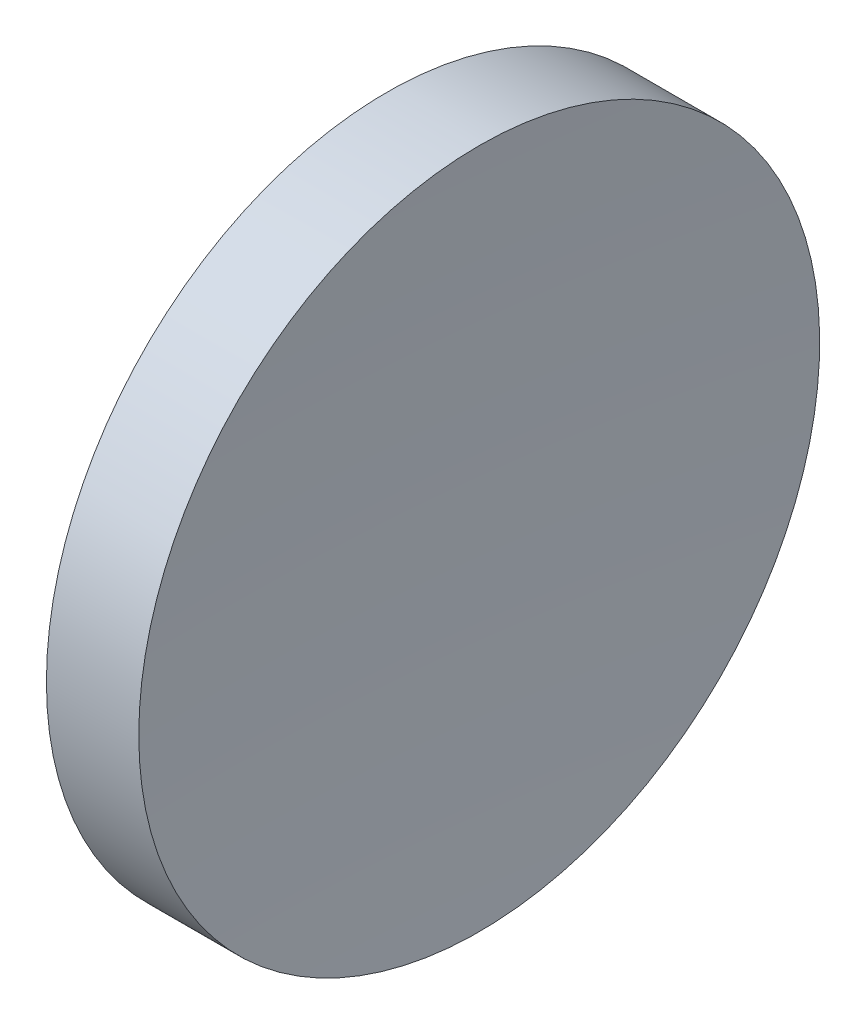
ISO-10303-21;
HEADER;
FILE_DESCRIPTION(('STEP AP214'),'2;1');
FILE_NAME('part.step','',(''),(''),'','','');
FILE_SCHEMA(('AUTOMOTIVE_DESIGN { 1 0 10303 214 1 1 1 1 }'));
ENDSEC;
DATA;
#1=APPLICATION_CONTEXT('core data for automotive mechanical design processes');
#2=APPLICATION_PROTOCOL_DEFINITION('international standard','automotive_design',2000,#1);
#3=PRODUCT_CONTEXT('',#1,'mechanical');
#4=PRODUCT('Part','Part','',(#3));
#5=PRODUCT_RELATED_PRODUCT_CATEGORY('part','',(#4));
#6=PRODUCT_DEFINITION_FORMATION('','',#4);
#7=PRODUCT_DEFINITION_CONTEXT('part definition',#1,'design');
#8=PRODUCT_DEFINITION('design','',#6,#7);
#9=PRODUCT_DEFINITION_SHAPE('','',#8);
#10=(LENGTH_UNIT() NAMED_UNIT(*) SI_UNIT(.MILLI.,.METRE.));
#11=(NAMED_UNIT(*) PLANE_ANGLE_UNIT() SI_UNIT($,.RADIAN.));
#12=(NAMED_UNIT(*) SI_UNIT($,.STERADIAN.) SOLID_ANGLE_UNIT());
#13=UNCERTAINTY_MEASURE_WITH_UNIT(LENGTH_MEASURE(1.E-05),#10,'distance_accuracy_value','');
#14=(GEOMETRIC_REPRESENTATION_CONTEXT(3) GLOBAL_UNCERTAINTY_ASSIGNED_CONTEXT((#13)) GLOBAL_UNIT_ASSIGNED_CONTEXT((#10,
#11,#12)) REPRESENTATION_CONTEXT('',''));
#15=CARTESIAN_POINT('',(0.,0.,0.));
#16=DIRECTION('',(0.,0.,1.));
#17=DIRECTION('',(1.,0.,0.));
#18=AXIS2_PLACEMENT_3D('',#15,#16,#17);
#19=CARTESIAN_POINT('',(839.199609056545,138.756042246744,0.));
#20=DIRECTION('',(-1.,0.,0.));
#21=DIRECTION('',(0.,1.,0.));
#22=AXIS2_PLACEMENT_3D('',#19,#20,#21);
#23=SPHERICAL_SURFACE('',#22,600.);
#24=CARTESIAN_POINT('',(240.372630706371,138.756042246745,0.));
#25=DIRECTION('',(-1.,0.,0.));
#26=DIRECTION('',(0.,0.,1.));
#27=AXIS2_PLACEMENT_3D('',#24,#25,#26);
#28=CIRCLE('',#27,37.5);
#29=CARTESIAN_POINT('',(240.372630706371,138.756042246745,37.5));
#30=VERTEX_POINT('',#29);
#31=EDGE_CURVE('E10',#30,#30,#28,.T.);
#32=ORIENTED_EDGE('',*,*,#31,.F.);
#33=EDGE_LOOP('',(#32));
#34=FACE_BOUND('',#33,.T.);
#35=ADVANCED_FACE('F35',(#34),#23,.F.);
#36=CARTESIAN_POINT('',(217.97028600433,138.756042246745,0.));
#37=DIRECTION('',(-1.,0.,0.));
#38=DIRECTION('',(0.,0.,1.));
#39=AXIS2_PLACEMENT_3D('',#36,#37,#38);
#40=CYLINDRICAL_SURFACE('',#39,37.5);
#41=CARTESIAN_POINT('',(230.199611905266,138.756042246745,0.));
#42=DIRECTION('',(-1.,0.,0.));
#43=DIRECTION('',(0.,0.,1.));
#44=AXIS2_PLACEMENT_3D('',#41,#42,#43);
#45=CIRCLE('',#44,37.5);
#46=CARTESIAN_POINT('',(230.199611905266,138.756042246745,37.5));
#47=VERTEX_POINT('',#46);
#48=EDGE_CURVE('E41',#47,#47,#45,.T.);
#49=ORIENTED_EDGE('',*,*,#48,.F.);
#50=EDGE_LOOP('',(#49));
#51=FACE_BOUND('',#50,.T.);
#52=ORIENTED_EDGE('',*,*,#31,.T.);
#53=EDGE_LOOP('',(#52));
#54=FACE_BOUND('',#53,.T.);
#55=ADVANCED_FACE('F49',(#51,#54),#40,.T.);
#56=CARTESIAN_POINT('',(230.199611905266,138.756042246745,0.));
#57=DIRECTION('',(1.,0.,0.));
#58=DIRECTION('',(0.,0.,-1.));
#59=AXIS2_PLACEMENT_3D('',#56,#57,#58);
#60=PLANE('',#59);
#61=ORIENTED_EDGE('',*,*,#48,.T.);
#62=EDGE_LOOP('',(#61));
#63=FACE_BOUND('',#62,.T.);
#64=ADVANCED_FACE('F47',(#63),#60,.F.);
#65=CLOSED_SHELL('',(#35,#55,#64));
#66=MANIFOLD_SOLID_BREP('B2',#65);
#67=ADVANCED_BREP_SHAPE_REPRESENTATION('',(#18,#66),#14);
#68=SHAPE_DEFINITION_REPRESENTATION(#9,#67);
ENDSEC;
END-ISO-10303-21;
